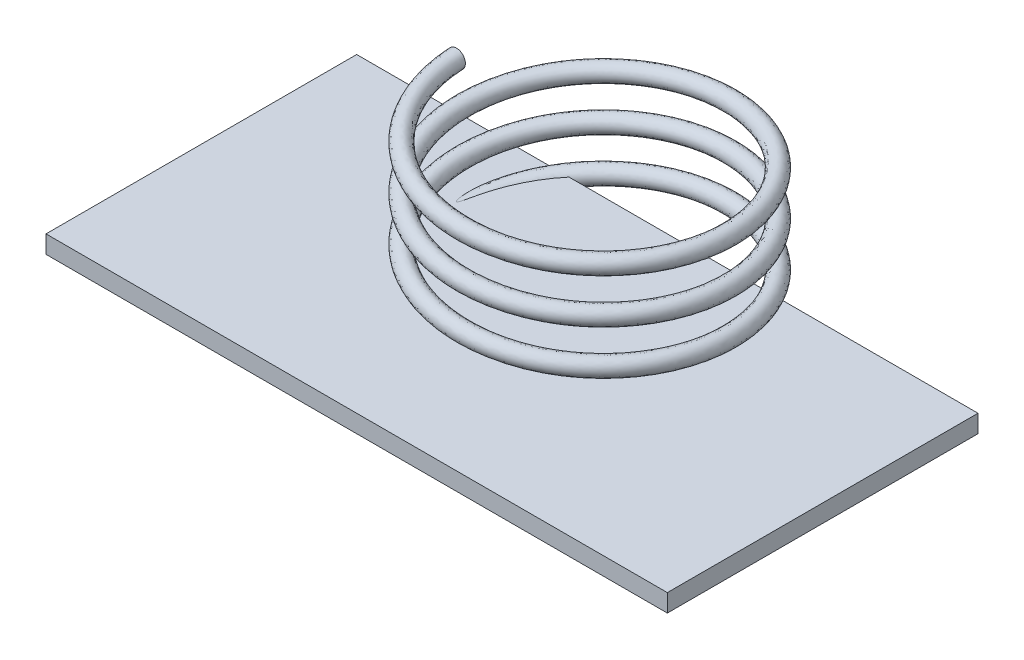
ISO-10303-21;
HEADER;
FILE_DESCRIPTION(('STEP AP214'),'2;1');
FILE_NAME('part.step','',(''),(''),'','','');
FILE_SCHEMA(('AUTOMOTIVE_DESIGN { 1 0 10303 214 1 1 1 1 }'));
ENDSEC;
DATA;
#1=APPLICATION_CONTEXT('core data for automotive mechanical design processes');
#2=APPLICATION_PROTOCOL_DEFINITION('international standard','automotive_design',2000,#1);
#3=PRODUCT_CONTEXT('',#1,'mechanical');
#4=PRODUCT('Part','Part','',(#3));
#5=PRODUCT_RELATED_PRODUCT_CATEGORY('part','',(#4));
#6=PRODUCT_DEFINITION_FORMATION('','',#4);
#7=PRODUCT_DEFINITION_CONTEXT('part definition',#1,'design');
#8=PRODUCT_DEFINITION('design','',#6,#7);
#9=PRODUCT_DEFINITION_SHAPE('','',#8);
#10=(LENGTH_UNIT() NAMED_UNIT(*) SI_UNIT(.MILLI.,.METRE.));
#11=(NAMED_UNIT(*) PLANE_ANGLE_UNIT() SI_UNIT($,.RADIAN.));
#12=(NAMED_UNIT(*) SI_UNIT($,.STERADIAN.) SOLID_ANGLE_UNIT());
#13=UNCERTAINTY_MEASURE_WITH_UNIT(LENGTH_MEASURE(1.E-05),#10,'distance_accuracy_value','');
#14=(GEOMETRIC_REPRESENTATION_CONTEXT(3) GLOBAL_UNCERTAINTY_ASSIGNED_CONTEXT((#13)) GLOBAL_UNIT_ASSIGNED_CONTEXT((#10,
#11,#12)) REPRESENTATION_CONTEXT('',''));
#15=CARTESIAN_POINT('',(0.,0.,0.));
#16=DIRECTION('',(0.,0.,1.));
#17=DIRECTION('',(1.,0.,0.));
#18=AXIS2_PLACEMENT_3D('',#15,#16,#17);
#19=CARTESIAN_POINT('',(-7.,0.2,-1.75));
#20=DIRECTION('',(0.,0.,1.));
#21=DIRECTION('',(1.,0.,0.));
#22=AXIS2_PLACEMENT_3D('',#19,#20,#21);
#23=PLANE('',#22);
#24=DIRECTION('',(-1.,0.,0.));
#25=VECTOR('',#24,1.);
#26=CARTESIAN_POINT('',(-7.,0.2,-1.75));
#27=LINE('',#26,#25);
#28=CARTESIAN_POINT('',(-2.64247759953754,0.2,-1.75));
#29=VERTEX_POINT('',#28);
#30=CARTESIAN_POINT('',(-7.,0.2,-1.75));
#31=VERTEX_POINT('',#30);
#32=EDGE_CURVE('E118',#29,#31,#27,.T.);
#33=ORIENTED_EDGE('',*,*,#32,.F.);
#34=CARTESIAN_POINT('',(-2.64247759953754,0.2,-1.75));
#35=CARTESIAN_POINT('',(-2.64857838421163,0.191740781433792,-1.75));
#36=CARTESIAN_POINT('',(-2.65405363247159,0.182997631658962,-1.75));
#37=CARTESIAN_POINT('',(-2.66354862552321,0.164717467188358,-1.75));
#38=CARTESIAN_POINT('',(-2.66756317230834,0.155177763089421,-1.74999999999999));
#39=CARTESIAN_POINT('',(-2.67389793442961,0.13550311313499,-1.74999999999999));
#40=CARTESIAN_POINT('',(-2.67621179620922,0.125366086487861,-1.75));
#41=CARTESIAN_POINT('',(-2.67895871192816,0.104857806044813,-1.75));
#42=CARTESIAN_POINT('',(-2.67939561045807,0.0944870748177028,-1.75));
#43=CARTESIAN_POINT('',(-2.67837653765016,0.0745431861483424,-1.75));
#44=CARTESIAN_POINT('',(-2.677046649976,0.0649635447973843,-1.75));
#45=CARTESIAN_POINT('',(-2.67276739276935,0.0461685255521735,-1.75));
#46=CARTESIAN_POINT('',(-2.66981600649397,0.0369536166268455,-1.75));
#47=CARTESIAN_POINT('',(-2.65885103265815,0.0106196480143113,-1.75));
#48=CARTESIAN_POINT('',(-2.64869481589577,-0.00564305893866261,-1.75000000000002));
#49=CARTESIAN_POINT('',(-2.62321519823818,-0.0355964841896774,-1.74999999999998));
#50=CARTESIAN_POINT('',(-2.60754707381542,-0.0489826627865754,-1.74999999999992));
#51=CARTESIAN_POINT('',(-2.57075625391253,-0.0727029235949012,-1.75000000000009));
#52=CARTESIAN_POINT('',(-2.54917054971502,-0.0823010576384543,-1.75000000000034));
#53=CARTESIAN_POINT('',(-2.50035904321947,-0.0967501371804446,-1.74999999999959));
#54=CARTESIAN_POINT('',(-2.4728112788733,-0.100459817954054,-1.74999999999835));
#55=CARTESIAN_POINT('',(-2.41332137926918,-0.100307841347221,-1.75000000000171));
#56=CARTESIAN_POINT('',(-2.38137728474093,-0.0951479342936403,-1.75000000000727));
#57=CARTESIAN_POINT('',(-2.33472744469786,-0.0798610059210955,-1.75000000000437));
#58=CARTESIAN_POINT('',(-2.31884924122077,-0.0731089436513186,-1.75000000000118));
#59=CARTESIAN_POINT('',(-2.28858301761561,-0.0568585791623826,-1.74999999999882));
#60=CARTESIAN_POINT('',(-2.2741934370708,-0.0473631930104592,-1.74999999999964));
#61=CARTESIAN_POINT('',(-2.24227591245923,-0.0211804100759317,-1.7500000000005));
#62=CARTESIAN_POINT('',(-2.22576825032585,-0.00313427188427725,-1.7500000000001));
#63=CARTESIAN_POINT('',(-2.20773009822856,0.0256041540197618,-1.74999999999997));
#64=CARTESIAN_POINT('',(-2.20309399415085,0.0344014369616938,-1.74999999999999));
#65=CARTESIAN_POINT('',(-2.19534038044084,0.0526348464124763,-1.75000000000001));
#66=CARTESIAN_POINT('',(-2.19221956226526,0.0620695293750241,-1.75000000000001));
#67=CARTESIAN_POINT('',(-2.18770339966077,0.0814205697922633,-1.75000000000001));
#68=CARTESIAN_POINT('',(-2.18632055345472,0.0913398891969704,-1.75000000000001));
#69=CARTESIAN_POINT('',(-2.18546656552838,0.111261004314224,-1.74999999999999));
#70=CARTESIAN_POINT('',(-2.18599450837104,0.121262758242414,-1.74999999999996));
#71=CARTESIAN_POINT('',(-2.18879175125063,0.139908934696055,-1.75000000000003));
#72=CARTESIAN_POINT('',(-2.19086670659152,0.148583236492156,-1.75000000000011));
#73=CARTESIAN_POINT('',(-2.19642457815608,0.165473498583388,-1.74999999999989));
#74=CARTESIAN_POINT('',(-2.19990885839138,0.173689006043741,-1.74999999999958));
#75=CARTESIAN_POINT('',(-2.20730823877636,0.18794580625468,-1.75000000000034));
#76=CARTESIAN_POINT('',(-2.21100811280008,0.194099405861328,-1.75000000000114));
#77=CARTESIAN_POINT('',(-2.21505889874939,0.200000000002381,-1.7500000000029));
#78=B_SPLINE_CURVE_WITH_KNOTS('',3,(#34,#35,#36,#37,#38,#39,#40,#41,#42,#43,#44,#45,#46,#47,#48,
#49,#50,#51,#52,#53,#54,#55,#56,#57,#58,#59,#60,#61,#62,#63,#64,#65,#66,#67,#68,#69,#70,#71,#72,
#73,#74,#75,#76,#77),.UNSPECIFIED.,.F.,.F.,(4,2,2,2,2,2,2,2,2,2,2,2,2,2,2,2,2,2,2,2,2,4),(0.,
0.0308021479542734,0.0617128595316258,0.0927384709064105,0.123700502019216,0.15256743686597,
0.181470356581194,0.237977321411011,0.298946765176776,0.368861502077114,0.451153828971883,
0.54653648918728,0.598060308836568,0.649529560527394,0.721421448744179,0.751146210946064,
0.780805775597682,0.810677431966371,0.840534779062765,0.867165598527106,0.893822254474849,
0.915299857300203),.UNSPECIFIED.);
#79=CARTESIAN_POINT('',(-2.21505889875016,0.200000000000002,-1.75000000000002));
#80=VERTEX_POINT('',#79);
#81=EDGE_CURVE('E11',#29,#80,#78,.T.);
#82=ORIENTED_EDGE('',*,*,#81,.T.);
#83=CARTESIAN_POINT('',(7.,0.2,-1.75));
#84=VERTEX_POINT('',#83);
#85=EDGE_CURVE('E56',#84,#80,#27,.T.);
#86=ORIENTED_EDGE('',*,*,#85,.F.);
#87=DIRECTION('',(0.,-1.,0.));
#88=VECTOR('',#87,1.);
#89=CARTESIAN_POINT('',(7.,0.2,-1.75));
#90=LINE('',#89,#88);
#91=CARTESIAN_POINT('',(7.,-0.2,-1.75));
#92=VERTEX_POINT('',#91);
#93=EDGE_CURVE('E88',#84,#92,#90,.T.);
#94=ORIENTED_EDGE('',*,*,#93,.T.);
#95=DIRECTION('',(-1.,0.,0.));
#96=VECTOR('',#95,1.);
#97=CARTESIAN_POINT('',(-7.,-0.2,-1.75));
#98=LINE('',#97,#96);
#99=CARTESIAN_POINT('',(-7.,-0.2,-1.75));
#100=VERTEX_POINT('',#99);
#101=EDGE_CURVE('E91',#92,#100,#98,.T.);
#102=ORIENTED_EDGE('',*,*,#101,.T.);
#103=DIRECTION('',(0.,-1.,0.));
#104=VECTOR('',#103,1.);
#105=CARTESIAN_POINT('',(-7.,0.2,-1.75));
#106=LINE('',#105,#104);
#107=EDGE_CURVE('E96',#31,#100,#106,.T.);
#108=ORIENTED_EDGE('',*,*,#107,.F.);
#109=EDGE_LOOP('',(#33,#82,#86,#94,#102,#108));
#110=FACE_BOUND('',#109,.T.);
#111=ADVANCED_FACE('F36',(#110),#23,.F.);
#112=CARTESIAN_POINT('',(0.,0.2,0.));
#113=DIRECTION('',(0.,1.,0.));
#114=DIRECTION('',(0.,0.,1.));
#115=AXIS2_PLACEMENT_3D('',#112,#113,#114);
#116=PLANE('',#115);
#117=CARTESIAN_POINT('',(-2.64247759953754,0.2,-1.75));
#118=CARTESIAN_POINT('',(-2.67747381271424,0.200000000000042,-1.69332401337829));
#119=CARTESIAN_POINT('',(-2.71054108519875,0.200000000000028,-1.63549203980028));
#120=CARTESIAN_POINT('',(-2.7727163334551,0.199999999999972,-1.51757669188435));
#121=CARTESIAN_POINT('',(-2.80181549820251,0.199999999999929,-1.45748867332051));
#122=CARTESIAN_POINT('',(-2.88328433175067,0.199999999999888,-1.27319469087391));
#123=CARTESIAN_POINT('',(-2.92917619220393,0.199999999999979,-1.1460051478302));
#124=CARTESIAN_POINT('',(-2.98374127056551,0.200000000000011,-0.951330048982492));
#125=CARTESIAN_POINT('',(-2.99955601170089,0.200000000000004,-0.885749598701762));
#126=CARTESIAN_POINT('',(-3.02616148156864,0.199999999999996,-0.753583985282303));
#127=CARTESIAN_POINT('',(-3.03695508879085,0.199999999999994,-0.686999420438095));
#128=CARTESIAN_POINT('',(-3.04958683896308,0.199999999999989,-0.582370966545075));
#129=CARTESIAN_POINT('',(-3.05327772556221,0.199999999999987,-0.544541914510432));
#130=CARTESIAN_POINT('',(-3.05881498813869,0.200000000000013,-0.468730370340561));
#131=CARTESIAN_POINT('',(-3.06066073220782,0.20000000000004,-0.4307478301083));
#132=CARTESIAN_POINT('',(-3.06230337607256,0.19999999999996,-0.354782574559535));
#133=CARTESIAN_POINT('',(-3.06210269488003,0.199999999999855,-0.316799912509993));
#134=CARTESIAN_POINT('',(-3.05930650658979,0.200000000000145,-0.240937859566931));
#135=CARTESIAN_POINT('',(-3.05671330574395,0.200000000000542,-0.203058404449137));
#136=CARTESIAN_POINT('',(-3.05023016474175,0.19999999999973,-0.146565665962181));
#137=CARTESIAN_POINT('',(-3.04764104663154,0.199999999999226,-0.127809057570869));
#138=CARTESIAN_POINT('',(-3.04278637664958,0.200000000000386,-0.0998583306409328));
#139=CARTESIAN_POINT('',(-3.04100854667288,0.200000000001091,-0.0905811587413487));
#140=CARTESIAN_POINT('',(-3.03700354584937,0.19999999999891,-0.0721260376028515));
#141=CARTESIAN_POINT('',(-3.03477653638894,0.199999999996025,-0.0629480539707239));
#142=CARTESIAN_POINT('',(-3.02957370677587,0.199999999995734,-0.0445158326250714));
#143=CARTESIAN_POINT('',(-3.02657863790969,0.199999999998484,-0.0352666749886172));
#144=CARTESIAN_POINT('',(-3.02064440919834,0.200000000000856,-0.0212452129663665));
#145=CARTESIAN_POINT('',(-3.0182454533005,0.200000000001319,-0.0162725483859705));
#146=CARTESIAN_POINT('',(-3.01379173965452,0.199999999999356,-0.00941538243461869));
#147=CARTESIAN_POINT('',(-3.01219054625031,0.199999999998289,-0.00725417075110244));
#148=CARTESIAN_POINT('',(-3.00890845974367,0.200000000001295,-0.00385768407377265));
#149=CARTESIAN_POINT('',(-3.00734174156294,0.200000000004181,-0.00252506159337916));
#150=CARTESIAN_POINT('',(-3.00444040902804,0.199999999997365,-0.000920666629614308));
#151=CARTESIAN_POINT('',(-3.00323404632076,0.199999999991921,-0.000438844371250891));
#152=CARTESIAN_POINT('',(-3.0007072788414,0.199999999992149,5.25027192303806E-05));
#153=CARTESIAN_POINT('',(-2.99938611549032,0.199999999997901,5.86019628900264E-05));
#154=CARTESIAN_POINT('',(-2.9969877644425,0.200000000001709,-0.000384995448041416));
#155=CARTESIAN_POINT('',(-2.99589980259089,0.200000000000552,-0.00078390999684284));
#156=CARTESIAN_POINT('',(-2.99310039053292,0.199999999998957,-0.00220262040945914));
#157=CARTESIAN_POINT('',(-2.9915219389351,0.199999999999682,-0.00346337909583232));
#158=CARTESIAN_POINT('',(-2.98817222846088,0.200000000000428,-0.00673710529584353));
#159=CARTESIAN_POINT('',(-2.98652336800808,0.200000000000121,-0.0088593848237632));
#160=CARTESIAN_POINT('',(-2.98350603330644,0.199999999999878,-0.0133061062692159));
#161=CARTESIAN_POINT('',(-2.98213962104466,0.199999999999946,-0.0156318698272892));
#162=CARTESIAN_POINT('',(-2.97813042767593,0.200000000000068,-0.0230802732398856));
#163=CARTESIAN_POINT('',(-2.975807465115,0.200000000000018,-0.028370030062749));
#164=CARTESIAN_POINT('',(-2.97152938922884,0.199999999999982,-0.0390985426178775));
#165=CARTESIAN_POINT('',(-2.96957530385384,0.199999999999995,-0.0445376677144614));
#166=CARTESIAN_POINT('',(-2.96589150360648,0.200000000000005,-0.0554975650532184));
#167=CARTESIAN_POINT('',(-2.96416198700809,0.200000000000001,-0.0610184047159463));
#168=CARTESIAN_POINT('',(-2.96084942547222,0.199999999999999,-0.0720937981208808));
#169=CARTESIAN_POINT('',(-2.95926616939849,0.199999999999999,-0.0776482905287035));
#170=CARTESIAN_POINT('',(-2.9546971827564,0.200000000000001,-0.0942179971787945));
#171=CARTESIAN_POINT('',(-2.95185089925147,0.2,-0.105271511462028));
#172=CARTESIAN_POINT('',(-2.94634406922099,0.2,-0.127424956981232));
#173=CARTESIAN_POINT('',(-2.94368354906084,0.2,-0.138524894570069));
#174=CARTESIAN_POINT('',(-2.93583359764529,0.2,-0.171873963170362));
#175=CARTESIAN_POINT('',(-2.93078018161473,0.2,-0.194154909911571));
#176=CARTESIAN_POINT('',(-2.9206807289278,0.2,-0.23866603461628));
#177=CARTESIAN_POINT('',(-2.91563470080284,0.2,-0.260896215450288));
#178=CARTESIAN_POINT('',(-2.90538557969575,0.2,-0.305315549288495));
#179=CARTESIAN_POINT('',(-2.90018251998968,0.2,-0.3275047099421));
#180=CARTESIAN_POINT('',(-2.8840282155022,0.2,-0.394648993957579));
#181=CARTESIAN_POINT('',(-2.87267678702187,0.2,-0.439510173807159));
#182=CARTESIAN_POINT('',(-2.84852950021178,0.2,-0.52884214502505));
#183=CARTESIAN_POINT('',(-2.83573363361061,0.2,-0.573312934156264));
#184=CARTESIAN_POINT('',(-2.79489619361761,0.2,-0.705993100311883));
#185=CARTESIAN_POINT('',(-2.76440483766452,0.2,-0.793470024313957));
#186=CARTESIAN_POINT('',(-2.6963277190653,0.2,-0.96563262122319));
#187=CARTESIAN_POINT('',(-2.65874143329428,0.2,-1.05031808776884));
#188=CARTESIAN_POINT('',(-2.57641872308355,0.2,-1.21612596467852));
#189=CARTESIAN_POINT('',(-2.53168429181135,0.2,-1.2972493602649));
#190=CARTESIAN_POINT('',(-2.44342444365765,0.2,-1.44174561515693));
#191=CARTESIAN_POINT('',(-2.40099159905137,0.2,-1.50578788502022));
#192=CARTESIAN_POINT('',(-2.31147439228525,0.2,-1.63050920448813));
#193=CARTESIAN_POINT('',(-2.26439117252896,0.199999999999998,-1.69118907440495));
#194=CARTESIAN_POINT('',(-2.2150588987502,0.199999999999995,-1.74999999999998));
#195=B_SPLINE_CURVE_WITH_KNOTS('',3,(#117,#118,#119,#120,#121,#122,#123,#124,#125,#126,#127,
#128,#129,#130,#131,#132,#133,#134,#135,#136,#137,#138,#139,#140,#141,#142,#143,#144,#145,#146,
#147,#148,#149,#150,#151,#152,#153,#154,#155,#156,#157,#158,#159,#160,#161,#162,#163,#164,#165,
#166,#167,#168,#169,#170,#171,#172,#173,#174,#175,#176,#177,#178,#179,#180,#181,#182,#183,#184,
#185,#186,#187,#188,#189,#190,#191,#192,#193,#194),.UNSPECIFIED.,.F.,.F.,(4,2,2,2,2,2,2,2,2,2,2,
2,2,2,2,2,2,2,2,2,2,2,2,2,2,2,2,2,2,2,2,2,2,2,2,2,2,2,4),(0.,0.199730362757841,
0.399897238102254,0.803895285155662,1.00613575394905,1.20826014005489,1.32225067931826,
1.43628024370039,1.55017503313106,1.66396014908657,1.72073133745851,1.74906122689063,
1.77738095570745,1.80649490721904,1.82296963583641,1.83100211676878,1.83708028089577,
1.84091184397951,1.84477099487171,1.84819953885709,1.8541603751822,1.86218461376911,
1.87026551075571,1.88755462872226,1.90489123713789,1.92224304961412,1.93956940889664,
1.97380722300807,2.00804988666156,2.07658917008894,2.14497625823,2.21334895505158,
2.35215269452195,2.49095722887557,2.76856707073102,3.04619738937603,3.3237504290697,
3.55401491263467,3.78422296983375),.UNSPECIFIED.);
#196=EDGE_CURVE('E49',#29,#80,#195,.T.);
#197=ORIENTED_EDGE('',*,*,#196,.F.);
#198=ORIENTED_EDGE('',*,*,#32,.T.);
#199=DIRECTION('',(0.,0.,1.));
#200=VECTOR('',#199,1.);
#201=CARTESIAN_POINT('',(-7.,0.2,-1.75));
#202=LINE('',#201,#200);
#203=CARTESIAN_POINT('',(-7.,0.2,5.25));
#204=VERTEX_POINT('',#203);
#205=EDGE_CURVE('E120',#31,#204,#202,.T.);
#206=ORIENTED_EDGE('',*,*,#205,.T.);
#207=DIRECTION('',(1.,0.,0.));
#208=VECTOR('',#207,1.);
#209=CARTESIAN_POINT('',(-7.,0.2,5.25));
#210=LINE('',#209,#208);
#211=CARTESIAN_POINT('',(7.,0.2,5.25));
#212=VERTEX_POINT('',#211);
#213=EDGE_CURVE('E122',#204,#212,#210,.T.);
#214=ORIENTED_EDGE('',*,*,#213,.T.);
#215=DIRECTION('',(0.,0.,-1.));
#216=VECTOR('',#215,1.);
#217=CARTESIAN_POINT('',(7.,0.2,-1.75));
#218=LINE('',#217,#216);
#219=EDGE_CURVE('E116',#212,#84,#218,.T.);
#220=ORIENTED_EDGE('',*,*,#219,.T.);
#221=ORIENTED_EDGE('',*,*,#85,.T.);
#222=EDGE_LOOP('',(#197,#198,#206,#214,#220,#221));
#223=FACE_BOUND('',#222,.T.);
#224=ADVANCED_FACE('F139',(#223),#116,.T.);
#225=CARTESIAN_POINT('',(7.,0.2,-1.75));
#226=DIRECTION('',(-1.,0.,0.));
#227=DIRECTION('',(0.,0.,1.));
#228=AXIS2_PLACEMENT_3D('',#225,#226,#227);
#229=PLANE('',#228);
#230=DIRECTION('',(0.,-1.,0.));
#231=VECTOR('',#230,1.);
#232=CARTESIAN_POINT('',(7.,0.2,5.25));
#233=LINE('',#232,#231);
#234=CARTESIAN_POINT('',(7.,-0.2,5.25));
#235=VERTEX_POINT('',#234);
#236=EDGE_CURVE('E110',#212,#235,#233,.T.);
#237=ORIENTED_EDGE('',*,*,#236,.T.);
#238=DIRECTION('',(0.,0.,-1.));
#239=VECTOR('',#238,1.);
#240=CARTESIAN_POINT('',(7.,-0.2,-1.75));
#241=LINE('',#240,#239);
#242=EDGE_CURVE('E103',#235,#92,#241,.T.);
#243=ORIENTED_EDGE('',*,*,#242,.T.);
#244=ORIENTED_EDGE('',*,*,#93,.F.);
#245=ORIENTED_EDGE('',*,*,#219,.F.);
#246=EDGE_LOOP('',(#237,#243,#244,#245));
#247=FACE_BOUND('',#246,.T.);
#248=ADVANCED_FACE('F108',(#247),#229,.F.);
#249=CARTESIAN_POINT('',(-7.,0.2,-1.75));
#250=DIRECTION('',(1.,0.,0.));
#251=DIRECTION('',(0.,0.,-1.));
#252=AXIS2_PLACEMENT_3D('',#249,#250,#251);
#253=PLANE('',#252);
#254=ORIENTED_EDGE('',*,*,#107,.T.);
#255=DIRECTION('',(0.,0.,1.));
#256=VECTOR('',#255,1.);
#257=CARTESIAN_POINT('',(-7.,-0.2,-1.75));
#258=LINE('',#257,#256);
#259=CARTESIAN_POINT('',(-7.,-0.2,5.25));
#260=VERTEX_POINT('',#259);
#261=EDGE_CURVE('E106',#100,#260,#258,.T.);
#262=ORIENTED_EDGE('',*,*,#261,.T.);
#263=DIRECTION('',(0.,-1.,0.));
#264=VECTOR('',#263,1.);
#265=CARTESIAN_POINT('',(-7.,0.2,5.25));
#266=LINE('',#265,#264);
#267=EDGE_CURVE('E125',#204,#260,#266,.T.);
#268=ORIENTED_EDGE('',*,*,#267,.F.);
#269=ORIENTED_EDGE('',*,*,#205,.F.);
#270=EDGE_LOOP('',(#254,#262,#268,#269));
#271=FACE_BOUND('',#270,.T.);
#272=ADVANCED_FACE('F147',(#271),#253,.F.);
#273=CARTESIAN_POINT('',(-7.,0.2,5.25));
#274=DIRECTION('',(0.,0.,-1.));
#275=DIRECTION('',(-1.,0.,0.));
#276=AXIS2_PLACEMENT_3D('',#273,#274,#275);
#277=PLANE('',#276);
#278=ORIENTED_EDGE('',*,*,#267,.T.);
#279=DIRECTION('',(1.,0.,0.));
#280=VECTOR('',#279,1.);
#281=CARTESIAN_POINT('',(-7.,-0.2,5.25));
#282=LINE('',#281,#280);
#283=EDGE_CURVE('E114',#260,#235,#282,.T.);
#284=ORIENTED_EDGE('',*,*,#283,.T.);
#285=ORIENTED_EDGE('',*,*,#236,.F.);
#286=ORIENTED_EDGE('',*,*,#213,.F.);
#287=EDGE_LOOP('',(#278,#284,#285,#286));
#288=FACE_BOUND('',#287,.T.);
#289=ADVANCED_FACE('F144',(#288),#277,.F.);
#290=CARTESIAN_POINT('',(0.,-0.2,0.));
#291=DIRECTION('',(0.,1.,0.));
#292=DIRECTION('',(0.,0.,1.));
#293=AXIS2_PLACEMENT_3D('',#290,#291,#292);
#294=PLANE('',#293);
#295=CARTESIAN_POINT('',(-2.99999999999923,-0.199999999999881,-2.36756801951592E-12));
#296=VERTEX_POINT('',#295);
#297=VERTEX_LOOP('',#296);
#298=FACE_BOUND('',#297,.T.);
#299=ORIENTED_EDGE('',*,*,#242,.F.);
#300=ORIENTED_EDGE('',*,*,#283,.F.);
#301=ORIENTED_EDGE('',*,*,#261,.F.);
#302=ORIENTED_EDGE('',*,*,#101,.F.);
#303=EDGE_LOOP('',(#299,#300,#301,#302));
#304=FACE_BOUND('',#303,.T.);
#305=ADVANCED_FACE('F101',(#298,#304),#294,.F.);
#306=CARTESIAN_POINT('',(-2.8,0.,0.));
#307=CARTESIAN_POINT('',(-2.8,0.0625,-1.15979797464467));
#308=CARTESIAN_POINT('',(-1.97989898732233,0.125,-1.97989898732233));
#309=CARTESIAN_POINT('',(-1.15979797464467,0.1875,-2.8));
#310=CARTESIAN_POINT('',(0.,0.25,-2.8));
#311=CARTESIAN_POINT('',(1.15979797464467,0.3125,-2.8));
#312=CARTESIAN_POINT('',(1.97989898732233,0.375,-1.97989898732233));
#313=CARTESIAN_POINT('',(2.8,0.4375,-1.15979797464467));
#314=CARTESIAN_POINT('',(2.8,0.5,0.));
#315=CARTESIAN_POINT('',(2.8,0.5625,1.15979797464467));
#316=CARTESIAN_POINT('',(1.97989898732233,0.625,1.97989898732233));
#317=CARTESIAN_POINT('',(1.15979797464467,0.6875,2.8));
#318=CARTESIAN_POINT('',(0.,0.75,2.8));
#319=CARTESIAN_POINT('',(-1.15979797464467,0.8125,2.8));
#320=CARTESIAN_POINT('',(-1.97989898732233,0.875,1.97989898732233));
#321=CARTESIAN_POINT('',(-2.8,0.9375,1.15979797464467));
#322=CARTESIAN_POINT('',(-2.8,1.,0.));
#323=CARTESIAN_POINT('',(-2.8,1.0625,-1.15979797464467));
#324=CARTESIAN_POINT('',(-1.97989898732233,1.125,-1.97989898732233));
#325=CARTESIAN_POINT('',(-1.15979797464467,1.1875,-2.8));
#326=CARTESIAN_POINT('',(0.,1.25,-2.8));
#327=CARTESIAN_POINT('',(1.15979797464467,1.3125,-2.8));
#328=CARTESIAN_POINT('',(1.97989898732233,1.375,-1.97989898732233));
#329=CARTESIAN_POINT('',(2.8,1.4375,-1.15979797464467));
#330=CARTESIAN_POINT('',(2.8,1.5,0.));
#331=CARTESIAN_POINT('',(2.8,1.5625,1.15979797464467));
#332=CARTESIAN_POINT('',(1.97989898732233,1.625,1.97989898732233));
#333=CARTESIAN_POINT('',(1.15979797464467,1.6875,2.8));
#334=CARTESIAN_POINT('',(0.,1.75,2.8));
#335=CARTESIAN_POINT('',(-1.15979797464467,1.8125,2.8));
#336=CARTESIAN_POINT('',(-1.97989898732233,1.875,1.97989898732233));
#337=CARTESIAN_POINT('',(-2.8,1.9375,1.15979797464467));
#338=CARTESIAN_POINT('',(-2.8,2.,0.));
#339=CARTESIAN_POINT('',(-2.8,2.0625,-1.15979797464467));
#340=CARTESIAN_POINT('',(-1.97989898732233,2.125,-1.97989898732233));
#341=CARTESIAN_POINT('',(-1.15979797464467,2.1875,-2.8));
#342=CARTESIAN_POINT('',(0.,2.25,-2.8));
#343=CARTESIAN_POINT('',(1.15979797464467,2.3125,-2.8));
#344=CARTESIAN_POINT('',(1.97989898732233,2.375,-1.97989898732233));
#345=CARTESIAN_POINT('',(2.8,2.4375,-1.15979797464467));
#346=CARTESIAN_POINT('',(2.8,2.5,0.));
#347=CARTESIAN_POINT('',(2.8,2.5625,1.15979797464467));
#348=CARTESIAN_POINT('',(1.97989898732233,2.625,1.97989898732233));
#349=CARTESIAN_POINT('',(1.15979797464467,2.6875,2.8));
#350=CARTESIAN_POINT('',(0.,2.75,2.8));
#351=CARTESIAN_POINT('',(-1.15979797464467,2.8125,2.8));
#352=CARTESIAN_POINT('',(-1.97989898732233,2.875,1.97989898732233));
#353=CARTESIAN_POINT('',(-2.8,2.9375,1.15979797464467));
#354=CARTESIAN_POINT('',(-2.8,3.,0.));
#355=CARTESIAN_POINT('',(-2.8,0.4,0.));
#356=CARTESIAN_POINT('',(-2.8,0.4625,-1.15979797464467));
#357=CARTESIAN_POINT('',(-1.97989898732233,0.525,-1.97989898732233));
#358=CARTESIAN_POINT('',(-1.15979797464467,0.5875,-2.8));
#359=CARTESIAN_POINT('',(0.,0.65,-2.8));
#360=CARTESIAN_POINT('',(1.15979797464467,0.712500000000001,-2.8));
#361=CARTESIAN_POINT('',(1.97989898732233,0.775,-1.97989898732233));
#362=CARTESIAN_POINT('',(2.8,0.8375,-1.15979797464467));
#363=CARTESIAN_POINT('',(2.8,0.9,0.));
#364=CARTESIAN_POINT('',(2.8,0.9625,1.15979797464467));
#365=CARTESIAN_POINT('',(1.97989898732233,1.025,1.97989898732233));
#366=CARTESIAN_POINT('',(1.15979797464467,1.0875,2.8));
#367=CARTESIAN_POINT('',(0.,1.15,2.8));
#368=CARTESIAN_POINT('',(-1.15979797464467,1.2125,2.8));
#369=CARTESIAN_POINT('',(-1.97989898732233,1.275,1.97989898732233));
#370=CARTESIAN_POINT('',(-2.8,1.3375,1.15979797464467));
#371=CARTESIAN_POINT('',(-2.8,1.4,0.));
#372=CARTESIAN_POINT('',(-2.8,1.4625,-1.15979797464467));
#373=CARTESIAN_POINT('',(-1.97989898732233,1.525,-1.97989898732233));
#374=CARTESIAN_POINT('',(-1.15979797464467,1.5875,-2.8));
#375=CARTESIAN_POINT('',(0.,1.65,-2.8));
#376=CARTESIAN_POINT('',(1.15979797464467,1.7125,-2.8));
#377=CARTESIAN_POINT('',(1.97989898732233,1.775,-1.97989898732233));
#378=CARTESIAN_POINT('',(2.8,1.8375,-1.15979797464467));
#379=CARTESIAN_POINT('',(2.8,1.9,0.));
#380=CARTESIAN_POINT('',(2.8,1.9625,1.15979797464467));
#381=CARTESIAN_POINT('',(1.97989898732233,2.025,1.97989898732233));
#382=CARTESIAN_POINT('',(1.15979797464467,2.0875,2.8));
#383=CARTESIAN_POINT('',(0.,2.15,2.8));
#384=CARTESIAN_POINT('',(-1.15979797464467,2.2125,2.8));
#385=CARTESIAN_POINT('',(-1.97989898732233,2.275,1.97989898732233));
#386=CARTESIAN_POINT('',(-2.8,2.3375,1.15979797464467));
#387=CARTESIAN_POINT('',(-2.8,2.4,0.));
#388=CARTESIAN_POINT('',(-2.8,2.4625,-1.15979797464467));
#389=CARTESIAN_POINT('',(-1.97989898732233,2.525,-1.97989898732233));
#390=CARTESIAN_POINT('',(-1.15979797464467,2.5875,-2.8));
#391=CARTESIAN_POINT('',(0.,2.65,-2.8));
#392=CARTESIAN_POINT('',(1.15979797464467,2.7125,-2.8));
#393=CARTESIAN_POINT('',(1.97989898732233,2.775,-1.97989898732233));
#394=CARTESIAN_POINT('',(2.8,2.8375,-1.15979797464467));
#395=CARTESIAN_POINT('',(2.8,2.9,0.));
#396=CARTESIAN_POINT('',(2.8,2.9625,1.15979797464467));
#397=CARTESIAN_POINT('',(1.97989898732233,3.025,1.97989898732233));
#398=CARTESIAN_POINT('',(1.15979797464467,3.0875,2.8));
#399=CARTESIAN_POINT('',(0.,3.15,2.8));
#400=CARTESIAN_POINT('',(-1.15979797464467,3.2125,2.8));
#401=CARTESIAN_POINT('',(-1.97989898732233,3.275,1.97989898732233));
#402=CARTESIAN_POINT('',(-2.8,3.3375,1.15979797464467));
#403=CARTESIAN_POINT('',(-2.8,3.4,0.));
#404=CARTESIAN_POINT('',(-3.2,0.4,0.));
#405=CARTESIAN_POINT('',(-3.2,0.4625,-1.3254833995939));
#406=CARTESIAN_POINT('',(-2.26274169979695,0.525,-2.26274169979695));
#407=CARTESIAN_POINT('',(-1.3254833995939,0.5875,-3.2));
#408=CARTESIAN_POINT('',(0.,0.65,-3.2));
#409=CARTESIAN_POINT('',(1.3254833995939,0.712500000000001,-3.2));
#410=CARTESIAN_POINT('',(2.26274169979695,0.775,-2.26274169979695));
#411=CARTESIAN_POINT('',(3.2,0.8375,-1.3254833995939));
#412=CARTESIAN_POINT('',(3.2,0.9,0.));
#413=CARTESIAN_POINT('',(3.2,0.9625,1.3254833995939));
#414=CARTESIAN_POINT('',(2.26274169979695,1.025,2.26274169979695));
#415=CARTESIAN_POINT('',(1.32548339959391,1.0875,3.2));
#416=CARTESIAN_POINT('',(0.,1.15,3.2));
#417=CARTESIAN_POINT('',(-1.3254833995939,1.2125,3.2));
#418=CARTESIAN_POINT('',(-2.26274169979695,1.275,2.26274169979695));
#419=CARTESIAN_POINT('',(-3.2,1.3375,1.32548339959391));
#420=CARTESIAN_POINT('',(-3.2,1.4,0.));
#421=CARTESIAN_POINT('',(-3.2,1.4625,-1.3254833995939));
#422=CARTESIAN_POINT('',(-2.26274169979695,1.525,-2.26274169979695));
#423=CARTESIAN_POINT('',(-1.3254833995939,1.5875,-3.2));
#424=CARTESIAN_POINT('',(0.,1.65,-3.2));
#425=CARTESIAN_POINT('',(1.3254833995939,1.7125,-3.2));
#426=CARTESIAN_POINT('',(2.26274169979695,1.775,-2.26274169979695));
#427=CARTESIAN_POINT('',(3.2,1.8375,-1.3254833995939));
#428=CARTESIAN_POINT('',(3.2,1.9,0.));
#429=CARTESIAN_POINT('',(3.2,1.9625,1.3254833995939));
#430=CARTESIAN_POINT('',(2.26274169979695,2.025,2.26274169979695));
#431=CARTESIAN_POINT('',(1.32548339959391,2.0875,3.2));
#432=CARTESIAN_POINT('',(0.,2.15,3.2));
#433=CARTESIAN_POINT('',(-1.3254833995939,2.2125,3.2));
#434=CARTESIAN_POINT('',(-2.26274169979695,2.275,2.26274169979695));
#435=CARTESIAN_POINT('',(-3.2,2.3375,1.32548339959391));
#436=CARTESIAN_POINT('',(-3.2,2.4,0.));
#437=CARTESIAN_POINT('',(-3.2,2.4625,-1.3254833995939));
#438=CARTESIAN_POINT('',(-2.26274169979695,2.525,-2.26274169979695));
#439=CARTESIAN_POINT('',(-1.3254833995939,2.5875,-3.2));
#440=CARTESIAN_POINT('',(0.,2.65,-3.2));
#441=CARTESIAN_POINT('',(1.3254833995939,2.7125,-3.2));
#442=CARTESIAN_POINT('',(2.26274169979695,2.775,-2.26274169979695));
#443=CARTESIAN_POINT('',(3.2,2.8375,-1.3254833995939));
#444=CARTESIAN_POINT('',(3.2,2.9,0.));
#445=CARTESIAN_POINT('',(3.2,2.9625,1.3254833995939));
#446=CARTESIAN_POINT('',(2.26274169979695,3.025,2.26274169979695));
#447=CARTESIAN_POINT('',(1.32548339959391,3.0875,3.2));
#448=CARTESIAN_POINT('',(0.,3.15,3.2));
#449=CARTESIAN_POINT('',(-1.3254833995939,3.2125,3.2));
#450=CARTESIAN_POINT('',(-2.26274169979695,3.275,2.26274169979695));
#451=CARTESIAN_POINT('',(-3.2,3.3375,1.32548339959391));
#452=CARTESIAN_POINT('',(-3.2,3.4,0.));
#453=CARTESIAN_POINT('',(-3.2,0.,0.));
#454=CARTESIAN_POINT('',(-3.2,0.0625,-1.3254833995939));
#455=CARTESIAN_POINT('',(-2.26274169979695,0.125,-2.26274169979695));
#456=CARTESIAN_POINT('',(-1.3254833995939,0.1875,-3.2));
#457=CARTESIAN_POINT('',(0.,0.25,-3.2));
#458=CARTESIAN_POINT('',(1.3254833995939,0.3125,-3.2));
#459=CARTESIAN_POINT('',(2.26274169979695,0.375,-2.26274169979695));
#460=CARTESIAN_POINT('',(3.2,0.4375,-1.3254833995939));
#461=CARTESIAN_POINT('',(3.2,0.5,0.));
#462=CARTESIAN_POINT('',(3.2,0.5625,1.3254833995939));
#463=CARTESIAN_POINT('',(2.26274169979695,0.625,2.26274169979695));
#464=CARTESIAN_POINT('',(1.32548339959391,0.6875,3.2));
#465=CARTESIAN_POINT('',(0.,0.75,3.2));
#466=CARTESIAN_POINT('',(-1.3254833995939,0.8125,3.2));
#467=CARTESIAN_POINT('',(-2.26274169979695,0.875,2.26274169979695));
#468=CARTESIAN_POINT('',(-3.2,0.9375,1.32548339959391));
#469=CARTESIAN_POINT('',(-3.2,1.,0.));
#470=CARTESIAN_POINT('',(-3.2,1.0625,-1.3254833995939));
#471=CARTESIAN_POINT('',(-2.26274169979695,1.125,-2.26274169979695));
#472=CARTESIAN_POINT('',(-1.3254833995939,1.1875,-3.2));
#473=CARTESIAN_POINT('',(0.,1.25,-3.2));
#474=CARTESIAN_POINT('',(1.3254833995939,1.3125,-3.2));
#475=CARTESIAN_POINT('',(2.26274169979695,1.375,-2.26274169979695));
#476=CARTESIAN_POINT('',(3.2,1.4375,-1.3254833995939));
#477=CARTESIAN_POINT('',(3.2,1.5,0.));
#478=CARTESIAN_POINT('',(3.2,1.5625,1.3254833995939));
#479=CARTESIAN_POINT('',(2.26274169979695,1.625,2.26274169979695));
#480=CARTESIAN_POINT('',(1.32548339959391,1.6875,3.2));
#481=CARTESIAN_POINT('',(0.,1.75,3.2));
#482=CARTESIAN_POINT('',(-1.3254833995939,1.8125,3.2));
#483=CARTESIAN_POINT('',(-2.26274169979695,1.875,2.26274169979695));
#484=CARTESIAN_POINT('',(-3.2,1.9375,1.32548339959391));
#485=CARTESIAN_POINT('',(-3.2,2.,0.));
#486=CARTESIAN_POINT('',(-3.2,2.0625,-1.3254833995939));
#487=CARTESIAN_POINT('',(-2.26274169979695,2.125,-2.26274169979695));
#488=CARTESIAN_POINT('',(-1.3254833995939,2.1875,-3.2));
#489=CARTESIAN_POINT('',(0.,2.25,-3.2));
#490=CARTESIAN_POINT('',(1.3254833995939,2.3125,-3.2));
#491=CARTESIAN_POINT('',(2.26274169979695,2.375,-2.26274169979695));
#492=CARTESIAN_POINT('',(3.2,2.4375,-1.3254833995939));
#493=CARTESIAN_POINT('',(3.2,2.5,0.));
#494=CARTESIAN_POINT('',(3.2,2.5625,1.3254833995939));
#495=CARTESIAN_POINT('',(2.26274169979695,2.625,2.26274169979695));
#496=CARTESIAN_POINT('',(1.32548339959391,2.6875,3.2));
#497=CARTESIAN_POINT('',(0.,2.75,3.2));
#498=CARTESIAN_POINT('',(-1.3254833995939,2.8125,3.2));
#499=CARTESIAN_POINT('',(-2.26274169979695,2.875,2.26274169979695));
#500=CARTESIAN_POINT('',(-3.2,2.9375,1.32548339959391));
#501=CARTESIAN_POINT('',(-3.2,3.,0.));
#502=CARTESIAN_POINT('',(-3.2,-0.4,0.));
#503=CARTESIAN_POINT('',(-3.2,-0.3375,-1.3254833995939));
#504=CARTESIAN_POINT('',(-2.26274169979695,-0.275,-2.26274169979695));
#505=CARTESIAN_POINT('',(-1.3254833995939,-0.2125,-3.2));
#506=CARTESIAN_POINT('',(0.,-0.15,-3.2));
#507=CARTESIAN_POINT('',(1.3254833995939,-0.0875000000000004,-3.2));
#508=CARTESIAN_POINT('',(2.26274169979695,-0.0250000000000004,-2.26274169979695));
#509=CARTESIAN_POINT('',(3.2,0.0374999999999996,-1.3254833995939));
#510=CARTESIAN_POINT('',(3.2,0.0999999999999996,0.));
#511=CARTESIAN_POINT('',(3.2,0.1625,1.3254833995939));
#512=CARTESIAN_POINT('',(2.26274169979695,0.225,2.26274169979695));
#513=CARTESIAN_POINT('',(1.32548339959391,0.2875,3.2));
#514=CARTESIAN_POINT('',(0.,0.35,3.2));
#515=CARTESIAN_POINT('',(-1.3254833995939,0.4125,3.2));
#516=CARTESIAN_POINT('',(-2.26274169979695,0.475,2.26274169979695));
#517=CARTESIAN_POINT('',(-3.2,0.5375,1.32548339959391));
#518=CARTESIAN_POINT('',(-3.2,0.6,0.));
#519=CARTESIAN_POINT('',(-3.2,0.6625,-1.3254833995939));
#520=CARTESIAN_POINT('',(-2.26274169979695,0.725,-2.26274169979695));
#521=CARTESIAN_POINT('',(-1.3254833995939,0.7875,-3.2));
#522=CARTESIAN_POINT('',(0.,0.85,-3.2));
#523=CARTESIAN_POINT('',(1.3254833995939,0.9125,-3.2));
#524=CARTESIAN_POINT('',(2.26274169979695,0.975,-2.26274169979695));
#525=CARTESIAN_POINT('',(3.2,1.0375,-1.3254833995939));
#526=CARTESIAN_POINT('',(3.2,1.1,0.));
#527=CARTESIAN_POINT('',(3.2,1.1625,1.3254833995939));
#528=CARTESIAN_POINT('',(2.26274169979695,1.225,2.26274169979695));
#529=CARTESIAN_POINT('',(1.32548339959391,1.2875,3.2));
#530=CARTESIAN_POINT('',(0.,1.35,3.2));
#531=CARTESIAN_POINT('',(-1.3254833995939,1.4125,3.2));
#532=CARTESIAN_POINT('',(-2.26274169979695,1.475,2.26274169979695));
#533=CARTESIAN_POINT('',(-3.2,1.5375,1.32548339959391));
#534=CARTESIAN_POINT('',(-3.2,1.6,0.));
#535=CARTESIAN_POINT('',(-3.2,1.6625,-1.3254833995939));
#536=CARTESIAN_POINT('',(-2.26274169979695,1.725,-2.26274169979695));
#537=CARTESIAN_POINT('',(-1.3254833995939,1.7875,-3.2));
#538=CARTESIAN_POINT('',(0.,1.85,-3.2));
#539=CARTESIAN_POINT('',(1.3254833995939,1.9125,-3.2));
#540=CARTESIAN_POINT('',(2.26274169979695,1.975,-2.26274169979695));
#541=CARTESIAN_POINT('',(3.2,2.0375,-1.3254833995939));
#542=CARTESIAN_POINT('',(3.2,2.1,0.));
#543=CARTESIAN_POINT('',(3.2,2.1625,1.3254833995939));
#544=CARTESIAN_POINT('',(2.26274169979695,2.225,2.26274169979695));
#545=CARTESIAN_POINT('',(1.32548339959391,2.2875,3.2));
#546=CARTESIAN_POINT('',(0.,2.35,3.2));
#547=CARTESIAN_POINT('',(-1.3254833995939,2.4125,3.2));
#548=CARTESIAN_POINT('',(-2.26274169979695,2.475,2.26274169979695));
#549=CARTESIAN_POINT('',(-3.2,2.5375,1.32548339959391));
#550=CARTESIAN_POINT('',(-3.2,2.6,0.));
#551=CARTESIAN_POINT('',(-2.8,-0.4,0.));
#552=CARTESIAN_POINT('',(-2.8,-0.3375,-1.15979797464467));
#553=CARTESIAN_POINT('',(-1.97989898732233,-0.275,-1.97989898732233));
#554=CARTESIAN_POINT('',(-1.15979797464467,-0.2125,-2.8));
#555=CARTESIAN_POINT('',(0.,-0.15,-2.8));
#556=CARTESIAN_POINT('',(1.15979797464467,-0.0875000000000004,-2.8));
#557=CARTESIAN_POINT('',(1.97989898732233,-0.0250000000000004,-1.97989898732233));
#558=CARTESIAN_POINT('',(2.8,0.0374999999999996,-1.15979797464467));
#559=CARTESIAN_POINT('',(2.8,0.0999999999999996,0.));
#560=CARTESIAN_POINT('',(2.8,0.1625,1.15979797464467));
#561=CARTESIAN_POINT('',(1.97989898732233,0.225,1.97989898732233));
#562=CARTESIAN_POINT('',(1.15979797464467,0.2875,2.8));
#563=CARTESIAN_POINT('',(0.,0.35,2.8));
#564=CARTESIAN_POINT('',(-1.15979797464467,0.4125,2.8));
#565=CARTESIAN_POINT('',(-1.97989898732233,0.475,1.97989898732233));
#566=CARTESIAN_POINT('',(-2.8,0.5375,1.15979797464467));
#567=CARTESIAN_POINT('',(-2.8,0.6,0.));
#568=CARTESIAN_POINT('',(-2.8,0.6625,-1.15979797464467));
#569=CARTESIAN_POINT('',(-1.97989898732233,0.725,-1.97989898732233));
#570=CARTESIAN_POINT('',(-1.15979797464467,0.7875,-2.8));
#571=CARTESIAN_POINT('',(0.,0.85,-2.8));
#572=CARTESIAN_POINT('',(1.15979797464467,0.9125,-2.8));
#573=CARTESIAN_POINT('',(1.97989898732233,0.975,-1.97989898732233));
#574=CARTESIAN_POINT('',(2.8,1.0375,-1.15979797464467));
#575=CARTESIAN_POINT('',(2.8,1.1,0.));
#576=CARTESIAN_POINT('',(2.8,1.1625,1.15979797464467));
#577=CARTESIAN_POINT('',(1.97989898732233,1.225,1.97989898732233));
#578=CARTESIAN_POINT('',(1.15979797464467,1.2875,2.8));
#579=CARTESIAN_POINT('',(0.,1.35,2.8));
#580=CARTESIAN_POINT('',(-1.15979797464467,1.4125,2.8));
#581=CARTESIAN_POINT('',(-1.97989898732233,1.475,1.97989898732233));
#582=CARTESIAN_POINT('',(-2.8,1.5375,1.15979797464467));
#583=CARTESIAN_POINT('',(-2.8,1.6,0.));
#584=CARTESIAN_POINT('',(-2.8,1.6625,-1.15979797464467));
#585=CARTESIAN_POINT('',(-1.97989898732233,1.725,-1.97989898732233));
#586=CARTESIAN_POINT('',(-1.15979797464467,1.7875,-2.8));
#587=CARTESIAN_POINT('',(0.,1.85,-2.8));
#588=CARTESIAN_POINT('',(1.15979797464467,1.9125,-2.8));
#589=CARTESIAN_POINT('',(1.97989898732233,1.975,-1.97989898732233));
#590=CARTESIAN_POINT('',(2.8,2.0375,-1.15979797464467));
#591=CARTESIAN_POINT('',(2.8,2.1,0.));
#592=CARTESIAN_POINT('',(2.8,2.1625,1.15979797464467));
#593=CARTESIAN_POINT('',(1.97989898732233,2.225,1.97989898732233));
#594=CARTESIAN_POINT('',(1.15979797464467,2.2875,2.8));
#595=CARTESIAN_POINT('',(0.,2.35,2.8));
#596=CARTESIAN_POINT('',(-1.15979797464467,2.4125,2.8));
#597=CARTESIAN_POINT('',(-1.97989898732233,2.475,1.97989898732233));
#598=CARTESIAN_POINT('',(-2.8,2.5375,1.15979797464467));
#599=CARTESIAN_POINT('',(-2.8,2.6,0.));
#600=CARTESIAN_POINT('',(-2.8,0.,0.));
#601=CARTESIAN_POINT('',(-2.8,0.0625,-1.15979797464467));
#602=CARTESIAN_POINT('',(-1.97989898732233,0.125,-1.97989898732233));
#603=CARTESIAN_POINT('',(-1.15979797464467,0.1875,-2.8));
#604=CARTESIAN_POINT('',(0.,0.25,-2.8));
#605=CARTESIAN_POINT('',(1.15979797464467,0.3125,-2.8));
#606=CARTESIAN_POINT('',(1.97989898732233,0.375,-1.97989898732233));
#607=CARTESIAN_POINT('',(2.8,0.4375,-1.15979797464467));
#608=CARTESIAN_POINT('',(2.8,0.5,0.));
#609=CARTESIAN_POINT('',(2.8,0.5625,1.15979797464467));
#610=CARTESIAN_POINT('',(1.97989898732233,0.625,1.97989898732233));
#611=CARTESIAN_POINT('',(1.15979797464467,0.6875,2.8));
#612=CARTESIAN_POINT('',(0.,0.75,2.8));
#613=CARTESIAN_POINT('',(-1.15979797464467,0.8125,2.8));
#614=CARTESIAN_POINT('',(-1.97989898732233,0.875,1.97989898732233));
#615=CARTESIAN_POINT('',(-2.8,0.9375,1.15979797464467));
#616=CARTESIAN_POINT('',(-2.8,1.,0.));
#617=CARTESIAN_POINT('',(-2.8,1.0625,-1.15979797464467));
#618=CARTESIAN_POINT('',(-1.97989898732233,1.125,-1.97989898732233));
#619=CARTESIAN_POINT('',(-1.15979797464467,1.1875,-2.8));
#620=CARTESIAN_POINT('',(0.,1.25,-2.8));
#621=CARTESIAN_POINT('',(1.15979797464467,1.3125,-2.8));
#622=CARTESIAN_POINT('',(1.97989898732233,1.375,-1.97989898732233));
#623=CARTESIAN_POINT('',(2.8,1.4375,-1.15979797464467));
#624=CARTESIAN_POINT('',(2.8,1.5,0.));
#625=CARTESIAN_POINT('',(2.8,1.5625,1.15979797464467));
#626=CARTESIAN_POINT('',(1.97989898732233,1.625,1.97989898732233));
#627=CARTESIAN_POINT('',(1.15979797464467,1.6875,2.8));
#628=CARTESIAN_POINT('',(0.,1.75,2.8));
#629=CARTESIAN_POINT('',(-1.15979797464467,1.8125,2.8));
#630=CARTESIAN_POINT('',(-1.97989898732233,1.875,1.97989898732233));
#631=CARTESIAN_POINT('',(-2.8,1.9375,1.15979797464467));
#632=CARTESIAN_POINT('',(-2.8,2.,0.));
#633=CARTESIAN_POINT('',(-2.8,2.0625,-1.15979797464467));
#634=CARTESIAN_POINT('',(-1.97989898732233,2.125,-1.97989898732233));
#635=CARTESIAN_POINT('',(-1.15979797464467,2.1875,-2.8));
#636=CARTESIAN_POINT('',(0.,2.25,-2.8));
#637=CARTESIAN_POINT('',(1.15979797464467,2.3125,-2.8));
#638=CARTESIAN_POINT('',(1.97989898732233,2.375,-1.97989898732233));
#639=CARTESIAN_POINT('',(2.8,2.4375,-1.15979797464467));
#640=CARTESIAN_POINT('',(2.8,2.5,0.));
#641=CARTESIAN_POINT('',(2.8,2.5625,1.15979797464467));
#642=CARTESIAN_POINT('',(1.97989898732233,2.625,1.97989898732233));
#643=CARTESIAN_POINT('',(1.15979797464467,2.6875,2.8));
#644=CARTESIAN_POINT('',(0.,2.75,2.8));
#645=CARTESIAN_POINT('',(-1.15979797464467,2.8125,2.8));
#646=CARTESIAN_POINT('',(-1.97989898732233,2.875,1.97989898732233));
#647=CARTESIAN_POINT('',(-2.8,2.9375,1.15979797464467));
#648=CARTESIAN_POINT('',(-2.8,3.,0.));
#649=(BOUNDED_SURFACE() B_SPLINE_SURFACE(3,2,((#306,#307,#308,#309,#310,#311,#312,#313,#314,
#315,#316,#317,#318,#319,#320,#321,#322,#323,#324,#325,#326,#327,#328,#329,#330,#331,#332,#333,
#334,#335,#336,#337,#338,#339,#340,#341,#342,#343,#344,#345,#346,#347,#348,#349,#350,#351,#352,
#353,#354),(#355,#356,#357,#358,#359,#360,#361,#362,#363,#364,#365,#366,#367,#368,#369,#370,
#371,#372,#373,#374,#375,#376,#377,#378,#379,#380,#381,#382,#383,#384,#385,#386,#387,#388,#389,
#390,#391,#392,#393,#394,#395,#396,#397,#398,#399,#400,#401,#402,#403),(#404,#405,#406,#407,
#408,#409,#410,#411,#412,#413,#414,#415,#416,#417,#418,#419,#420,#421,#422,#423,#424,#425,#426,
#427,#428,#429,#430,#431,#432,#433,#434,#435,#436,#437,#438,#439,#440,#441,#442,#443,#444,#445,
#446,#447,#448,#449,#450,#451,#452),(#453,#454,#455,#456,#457,#458,#459,#460,#461,#462,#463,
#464,#465,#466,#467,#468,#469,#470,#471,#472,#473,#474,#475,#476,#477,#478,#479,#480,#481,#482,
#483,#484,#485,#486,#487,#488,#489,#490,#491,#492,#493,#494,#495,#496,#497,#498,#499,#500,#501),
(#502,#503,#504,#505,#506,#507,#508,#509,#510,#511,#512,#513,#514,#515,#516,#517,#518,#519,#520,
#521,#522,#523,#524,#525,#526,#527,#528,#529,#530,#531,#532,#533,#534,#535,#536,#537,#538,#539,
#540,#541,#542,#543,#544,#545,#546,#547,#548,#549,#550),(#551,#552,#553,#554,#555,#556,#557,
#558,#559,#560,#561,#562,#563,#564,#565,#566,#567,#568,#569,#570,#571,#572,#573,#574,#575,#576,
#577,#578,#579,#580,#581,#582,#583,#584,#585,#586,#587,#588,#589,#590,#591,#592,#593,#594,#595,
#596,#597,#598,#599),(#600,#601,#602,#603,#604,#605,#606,#607,#608,#609,#610,#611,#612,#613,
#614,#615,#616,#617,#618,#619,#620,#621,#622,#623,#624,#625,#626,#627,#628,#629,#630,#631,#632,
#633,#634,#635,#636,#637,#638,#639,#640,#641,#642,#643,#644,#645,#646,#647,#648)),.UNSPECIFIED.,
.T.,.F.,.F.) B_SPLINE_SURFACE_WITH_KNOTS((4,3,4),(3,2,2,2,2,2,2,2,2,2,2,2,2,2,2,2,2,2,2,2,2,2,2,
2,3),(0.,0.5,1.),(0.,0.0416666666666667,0.0833333333333333,0.125,0.166666666666667,
0.208333333333333,0.25,0.291666666666667,0.333333333333333,0.375,0.416666666666667,
0.458333333333333,0.5,0.541666666666667,0.583333333333333,0.625,0.666666666666667,
0.708333333333333,0.75,0.791666666666667,0.833333333333333,0.875,0.916666666666667,
0.958333333333333,1.),
.UNSPECIFIED.) GEOMETRIC_REPRESENTATION_ITEM() RATIONAL_B_SPLINE_SURFACE(((1.,0.923879532511287,
1.,0.923879532511287,1.,0.923879532511287,1.,0.923879532511287,1.,0.923879532511287,1.,
0.923879532511287,1.,0.923879532511287,1.,0.923879532511287,1.,0.923879532511287,1.,
0.923879532511287,1.,0.923879532511287,1.,0.923879532511287,1.,0.923879532511287,1.,
0.923879532511287,1.,0.923879532511287,1.,0.923879532511287,1.,0.923879532511287,1.,
0.923879532511287,1.,0.923879532511287,1.,0.923879532511287,1.,0.923879532511287,1.,
0.923879532511287,1.,0.923879532511287,1.,0.923879532511287,1.),(0.333333333333333,
0.307959844170429,0.333333333333333,0.307959844170429,0.333333333333333,0.307959844170429,
0.333333333333333,0.307959844170429,0.333333333333333,0.307959844170429,0.333333333333333,
0.307959844170429,0.333333333333333,0.307959844170429,0.333333333333333,0.307959844170429,
0.333333333333333,0.307959844170429,0.333333333333333,0.307959844170429,0.333333333333333,
0.307959844170429,0.333333333333333,0.307959844170429,0.333333333333333,0.307959844170429,
0.333333333333333,0.307959844170429,0.333333333333333,0.307959844170429,0.333333333333333,
0.307959844170429,0.333333333333333,0.307959844170429,0.333333333333333,0.307959844170429,
0.333333333333333,0.307959844170429,0.333333333333333,0.307959844170429,0.333333333333333,
0.307959844170429,0.333333333333333,0.307959844170429,0.333333333333333,0.307959844170429,
0.333333333333333,0.307959844170429,0.333333333333333),(0.333333333333333,0.307959844170429,
0.333333333333333,0.307959844170429,0.333333333333333,0.307959844170429,0.333333333333333,
0.307959844170429,0.333333333333333,0.307959844170429,0.333333333333333,0.307959844170429,
0.333333333333333,0.307959844170429,0.333333333333333,0.307959844170429,0.333333333333333,
0.307959844170429,0.333333333333333,0.307959844170429,0.333333333333333,0.307959844170429,
0.333333333333333,0.307959844170429,0.333333333333333,0.307959844170429,0.333333333333333,
0.307959844170429,0.333333333333333,0.307959844170429,0.333333333333333,0.307959844170429,
0.333333333333333,0.307959844170429,0.333333333333333,0.307959844170429,0.333333333333333,
0.307959844170429,0.333333333333333,0.307959844170429,0.333333333333333,0.307959844170429,
0.333333333333333,0.307959844170429,0.333333333333333,0.307959844170429,0.333333333333333,
0.307959844170429,0.333333333333333),(1.,0.923879532511287,1.,0.923879532511287,1.,
0.923879532511287,1.,0.923879532511287,1.,0.923879532511287,1.,0.923879532511287,1.,
0.923879532511287,1.,0.923879532511287,1.,0.923879532511287,1.,0.923879532511287,1.,
0.923879532511287,1.,0.923879532511287,1.,0.923879532511287,1.,0.923879532511287,1.,
0.923879532511287,1.,0.923879532511287,1.,0.923879532511287,1.,0.923879532511287,1.,
0.923879532511287,1.,0.923879532511287,1.,0.923879532511287,1.,0.923879532511287,1.,
0.923879532511287,1.,0.923879532511287,1.),(0.333333333333333,0.307959844170429,
0.333333333333333,0.307959844170429,0.333333333333333,0.307959844170429,0.333333333333333,
0.307959844170429,0.333333333333333,0.307959844170429,0.333333333333333,0.307959844170429,
0.333333333333333,0.307959844170429,0.333333333333333,0.307959844170429,0.333333333333333,
0.307959844170429,0.333333333333333,0.307959844170429,0.333333333333333,0.307959844170429,
0.333333333333333,0.307959844170429,0.333333333333333,0.307959844170429,0.333333333333333,
0.307959844170429,0.333333333333333,0.307959844170429,0.333333333333333,0.307959844170429,
0.333333333333333,0.307959844170429,0.333333333333333,0.307959844170429,0.333333333333333,
0.307959844170429,0.333333333333333,0.307959844170429,0.333333333333333,0.307959844170429,
0.333333333333333,0.307959844170429,0.333333333333333,0.307959844170429,0.333333333333333,
0.307959844170429,0.333333333333333),(0.333333333333333,0.307959844170429,0.333333333333333,
0.307959844170429,0.333333333333333,0.307959844170429,0.333333333333333,0.307959844170429,
0.333333333333333,0.307959844170429,0.333333333333333,0.307959844170429,0.333333333333333,
0.307959844170429,0.333333333333333,0.307959844170429,0.333333333333333,0.307959844170429,
0.333333333333333,0.307959844170429,0.333333333333333,0.307959844170429,0.333333333333333,
0.307959844170429,0.333333333333333,0.307959844170429,0.333333333333333,0.307959844170429,
0.333333333333333,0.307959844170429,0.333333333333333,0.307959844170429,0.333333333333333,
0.307959844170429,0.333333333333333,0.307959844170429,0.333333333333333,0.307959844170429,
0.333333333333333,0.307959844170429,0.333333333333333,0.307959844170429,0.333333333333333,
0.307959844170429,0.333333333333333,0.307959844170429,0.333333333333333,0.307959844170429,
0.333333333333333),(1.,0.923879532511287,1.,0.923879532511287,1.,0.923879532511287,1.,
0.923879532511287,1.,0.923879532511287,1.,0.923879532511287,1.,0.923879532511287,1.,
0.923879532511287,1.,0.923879532511287,1.,0.923879532511287,1.,0.923879532511287,1.,
0.923879532511287,1.,0.923879532511287,1.,0.923879532511287,1.,0.923879532511287,1.,
0.923879532511287,1.,0.923879532511287,1.,0.923879532511287,1.,0.923879532511287,1.,
0.923879532511287,1.,0.923879532511287,1.,0.923879532511287,1.,0.923879532511287,1.,
0.923879532511287,1.))) REPRESENTATION_ITEM('') SURFACE());
#650=CARTESIAN_POINT('',(-3.,3.,0.));
#651=DIRECTION('',(0.,0.,-1.));
#652=DIRECTION('',(1.,0.,0.));
#653=AXIS2_PLACEMENT_3D('',#650,#651,#652);
#654=CIRCLE('',#653,0.2);
#655=CARTESIAN_POINT('',(-2.8,3.,0.));
#656=VERTEX_POINT('',#655);
#657=EDGE_CURVE('E95',#656,#656,#654,.T.);
#658=ORIENTED_EDGE('',*,*,#657,.F.);
#659=EDGE_LOOP('',(#658));
#660=FACE_BOUND('',#659,.T.);
#661=ORIENTED_EDGE('',*,*,#81,.F.);
#662=ORIENTED_EDGE('',*,*,#196,.T.);
#663=EDGE_LOOP('',(#661,#662));
#664=FACE_BOUND('',#663,.T.);
#665=ADVANCED_FACE('F134',(#660,#664),#649,.F.);
#666=CARTESIAN_POINT('',(-3.2,3.,0.));
#667=DIRECTION('',(0.,0.,-1.));
#668=DIRECTION('',(-1.,0.,0.));
#669=AXIS2_PLACEMENT_3D('',#666,#667,#668);
#670=PLANE('',#669);
#671=ORIENTED_EDGE('',*,*,#657,.T.);
#672=EDGE_LOOP('',(#671));
#673=FACE_BOUND('',#672,.T.);
#674=ADVANCED_FACE('F38',(#673),#670,.T.);
#675=CLOSED_SHELL('',(#111,#224,#248,#272,#289,#305,#665,#674));
#676=MANIFOLD_SOLID_BREP('B2',#675);
#677=ADVANCED_BREP_SHAPE_REPRESENTATION('',(#18,#676),#14);
#678=SHAPE_DEFINITION_REPRESENTATION(#9,#677);
ENDSEC;
END-ISO-10303-21;
